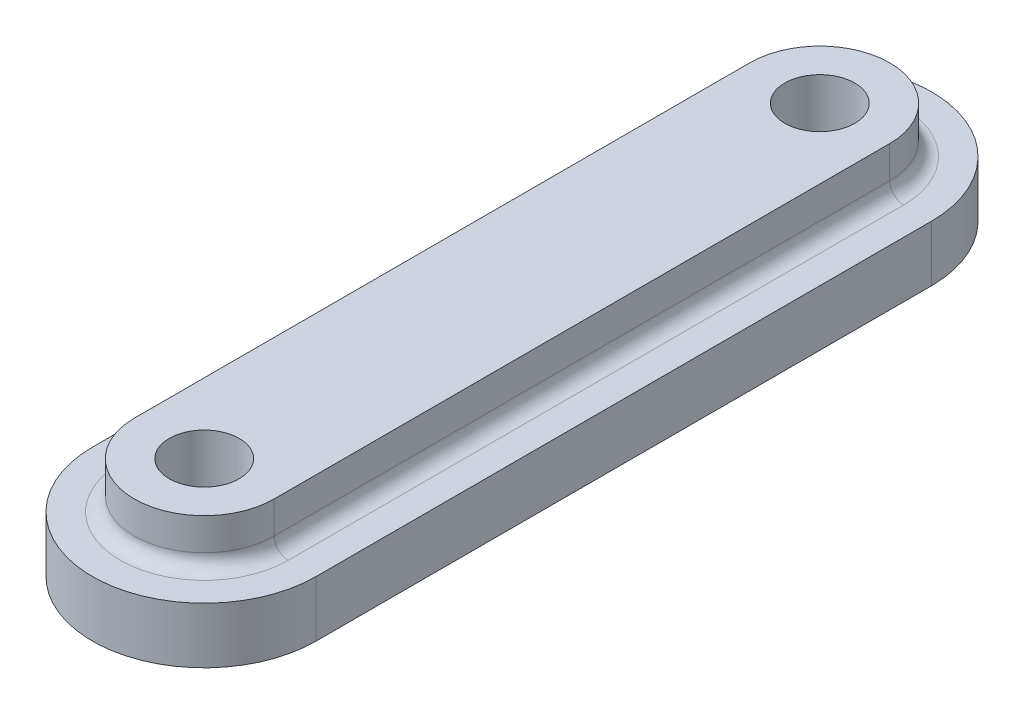
ISO-10303-21;
HEADER;
FILE_DESCRIPTION(('STEP AP214'),'2;1');
FILE_NAME('part.step','',(''),(''),'','','');
FILE_SCHEMA(('AUTOMOTIVE_DESIGN { 1 0 10303 214 1 1 1 1 }'));
ENDSEC;
DATA;
#1=APPLICATION_CONTEXT('core data for automotive mechanical design processes');
#2=APPLICATION_PROTOCOL_DEFINITION('international standard','automotive_design',2000,#1);
#3=PRODUCT_CONTEXT('',#1,'mechanical');
#4=PRODUCT('Part','Part','',(#3));
#5=PRODUCT_RELATED_PRODUCT_CATEGORY('part','',(#4));
#6=PRODUCT_DEFINITION_FORMATION('','',#4);
#7=PRODUCT_DEFINITION_CONTEXT('part definition',#1,'design');
#8=PRODUCT_DEFINITION('design','',#6,#7);
#9=PRODUCT_DEFINITION_SHAPE('','',#8);
#10=(LENGTH_UNIT() NAMED_UNIT(*) SI_UNIT(.MILLI.,.METRE.));
#11=(NAMED_UNIT(*) PLANE_ANGLE_UNIT() SI_UNIT($,.RADIAN.));
#12=(NAMED_UNIT(*) SI_UNIT($,.STERADIAN.) SOLID_ANGLE_UNIT());
#13=UNCERTAINTY_MEASURE_WITH_UNIT(LENGTH_MEASURE(1.E-05),#10,'distance_accuracy_value','');
#14=(GEOMETRIC_REPRESENTATION_CONTEXT(3) GLOBAL_UNCERTAINTY_ASSIGNED_CONTEXT((#13)) GLOBAL_UNIT_ASSIGNED_CONTEXT((#10,
#11,#12)) REPRESENTATION_CONTEXT('',''));
#15=CARTESIAN_POINT('',(0.,0.,0.));
#16=DIRECTION('',(0.,0.,1.));
#17=DIRECTION('',(1.,0.,0.));
#18=AXIS2_PLACEMENT_3D('',#15,#16,#17);
#19=CARTESIAN_POINT('',(38.,-2.825,11.));
#20=DIRECTION('',(0.,1.,0.));
#21=DIRECTION('',(0.,0.,1.));
#22=AXIS2_PLACEMENT_3D('',#19,#20,#21);
#23=CYLINDRICAL_SURFACE('',#22,4.);
#24=CARTESIAN_POINT('',(38.,-0.825,11.));
#25=DIRECTION('',(0.,1.,0.));
#26=DIRECTION('',(0.,0.,1.));
#27=AXIS2_PLACEMENT_3D('',#24,#25,#26);
#28=CIRCLE('',#27,4.);
#29=CARTESIAN_POINT('',(34.,-0.825,11.));
#30=VERTEX_POINT('',#29);
#31=CARTESIAN_POINT('',(42.,-0.825,11.));
#32=VERTEX_POINT('',#31);
#33=EDGE_CURVE('E135',#30,#32,#28,.T.);
#34=ORIENTED_EDGE('',*,*,#33,.F.);
#35=DIRECTION('',(0.,1.,0.));
#36=VECTOR('',#35,1.);
#37=CARTESIAN_POINT('',(34.,-2.825,11.));
#38=LINE('',#37,#36);
#39=CARTESIAN_POINT('',(34.,-2.825,11.));
#40=VERTEX_POINT('',#39);
#41=EDGE_CURVE('E165',#40,#30,#38,.T.);
#42=ORIENTED_EDGE('',*,*,#41,.F.);
#43=CARTESIAN_POINT('',(38.,-2.825,11.));
#44=DIRECTION('',(0.,1.,0.));
#45=DIRECTION('',(0.,0.,1.));
#46=AXIS2_PLACEMENT_3D('',#43,#44,#45);
#47=CIRCLE('',#46,4.);
#48=CARTESIAN_POINT('',(42.,-2.825,11.));
#49=VERTEX_POINT('',#48);
#50=EDGE_CURVE('E144',#40,#49,#47,.T.);
#51=ORIENTED_EDGE('',*,*,#50,.T.);
#52=DIRECTION('',(0.,1.,0.));
#53=VECTOR('',#52,1.);
#54=CARTESIAN_POINT('',(42.,-2.825,11.));
#55=LINE('',#54,#53);
#56=EDGE_CURVE('E156',#49,#32,#55,.T.);
#57=ORIENTED_EDGE('',*,*,#56,.T.);
#58=EDGE_LOOP('',(#34,#42,#51,#57));
#59=FACE_BOUND('',#58,.T.);
#60=ADVANCED_FACE('F33',(#59),#23,.T.);
#61=CARTESIAN_POINT('',(34.,-2.825,-11.));
#62=DIRECTION('',(-1.,0.,0.));
#63=DIRECTION('',(0.,0.,1.));
#64=AXIS2_PLACEMENT_3D('',#61,#62,#63);
#65=PLANE('',#64);
#66=DIRECTION('',(0.,0.,1.));
#67=VECTOR('',#66,1.);
#68=CARTESIAN_POINT('',(34.,-0.825,-11.));
#69=LINE('',#68,#67);
#70=CARTESIAN_POINT('',(34.,-0.825,-11.));
#71=VERTEX_POINT('',#70);
#72=EDGE_CURVE('E148',#71,#30,#69,.T.);
#73=ORIENTED_EDGE('',*,*,#72,.F.);
#74=DIRECTION('',(0.,1.,0.));
#75=VECTOR('',#74,1.);
#76=CARTESIAN_POINT('',(34.,-2.825,-11.));
#77=LINE('',#76,#75);
#78=CARTESIAN_POINT('',(34.,-2.825,-11.));
#79=VERTEX_POINT('',#78);
#80=EDGE_CURVE('E168',#79,#71,#77,.T.);
#81=ORIENTED_EDGE('',*,*,#80,.F.);
#82=DIRECTION('',(0.,0.,1.));
#83=VECTOR('',#82,1.);
#84=CARTESIAN_POINT('',(34.,-2.825,-11.));
#85=LINE('',#84,#83);
#86=EDGE_CURVE('E154',#79,#40,#85,.T.);
#87=ORIENTED_EDGE('',*,*,#86,.T.);
#88=ORIENTED_EDGE('',*,*,#41,.T.);
#89=EDGE_LOOP('',(#73,#81,#87,#88));
#90=FACE_BOUND('',#89,.T.);
#91=ADVANCED_FACE('F233',(#90),#65,.T.);
#92=CARTESIAN_POINT('',(38.,-2.825,-11.));
#93=DIRECTION('',(0.,1.,0.));
#94=DIRECTION('',(0.,0.,1.));
#95=AXIS2_PLACEMENT_3D('',#92,#93,#94);
#96=CYLINDRICAL_SURFACE('',#95,4.);
#97=CARTESIAN_POINT('',(38.,-0.825,-11.));
#98=DIRECTION('',(0.,1.,0.));
#99=DIRECTION('',(0.,0.,1.));
#100=AXIS2_PLACEMENT_3D('',#97,#98,#99);
#101=CIRCLE('',#100,4.);
#102=CARTESIAN_POINT('',(42.,-0.825,-11.));
#103=VERTEX_POINT('',#102);
#104=EDGE_CURVE('E160',#103,#71,#101,.T.);
#105=ORIENTED_EDGE('',*,*,#104,.F.);
#106=DIRECTION('',(0.,1.,0.));
#107=VECTOR('',#106,1.);
#108=CARTESIAN_POINT('',(42.,-2.825,-11.));
#109=LINE('',#108,#107);
#110=CARTESIAN_POINT('',(42.,-2.825,-11.));
#111=VERTEX_POINT('',#110);
#112=EDGE_CURVE('E170',#111,#103,#109,.T.);
#113=ORIENTED_EDGE('',*,*,#112,.F.);
#114=CARTESIAN_POINT('',(38.,-2.825,-11.));
#115=DIRECTION('',(0.,1.,0.));
#116=DIRECTION('',(0.,0.,1.));
#117=AXIS2_PLACEMENT_3D('',#114,#115,#116);
#118=CIRCLE('',#117,4.);
#119=EDGE_CURVE('E151',#111,#79,#118,.T.);
#120=ORIENTED_EDGE('',*,*,#119,.T.);
#121=ORIENTED_EDGE('',*,*,#80,.T.);
#122=EDGE_LOOP('',(#105,#113,#120,#121));
#123=FACE_BOUND('',#122,.T.);
#124=ADVANCED_FACE('F239',(#123),#96,.T.);
#125=CARTESIAN_POINT('',(42.,-2.825,11.));
#126=DIRECTION('',(1.,0.,0.));
#127=DIRECTION('',(0.,0.,-1.));
#128=AXIS2_PLACEMENT_3D('',#125,#126,#127);
#129=PLANE('',#128);
#130=DIRECTION('',(0.,0.,-1.));
#131=VECTOR('',#130,1.);
#132=CARTESIAN_POINT('',(42.,-0.825,11.));
#133=LINE('',#132,#131);
#134=EDGE_CURVE('E138',#32,#103,#133,.T.);
#135=ORIENTED_EDGE('',*,*,#134,.F.);
#136=ORIENTED_EDGE('',*,*,#56,.F.);
#137=DIRECTION('',(0.,0.,-1.));
#138=VECTOR('',#137,1.);
#139=CARTESIAN_POINT('',(42.,-2.825,11.));
#140=LINE('',#139,#138);
#141=EDGE_CURVE('E147',#49,#111,#140,.T.);
#142=ORIENTED_EDGE('',*,*,#141,.T.);
#143=ORIENTED_EDGE('',*,*,#112,.T.);
#144=EDGE_LOOP('',(#135,#136,#142,#143));
#145=FACE_BOUND('',#144,.T.);
#146=ADVANCED_FACE('F245',(#145),#129,.T.);
#147=CARTESIAN_POINT('',(38.,-2.825,11.));
#148=DIRECTION('',(0.,1.,0.));
#149=DIRECTION('',(0.,0.,1.));
#150=AXIS2_PLACEMENT_3D('',#147,#148,#149);
#151=PLANE('',#150);
#152=CARTESIAN_POINT('',(38.,-2.825,11.));
#153=DIRECTION('',(0.,1.,0.));
#154=DIRECTION('',(0.,0.,1.));
#155=AXIS2_PLACEMENT_3D('',#152,#153,#154);
#156=CIRCLE('',#155,1.24999999999999);
#157=CARTESIAN_POINT('',(38.,-2.825,12.25));
#158=VERTEX_POINT('',#157);
#159=EDGE_CURVE('E199',#158,#158,#156,.T.);
#160=ORIENTED_EDGE('',*,*,#159,.T.);
#161=EDGE_LOOP('',(#160));
#162=FACE_BOUND('',#161,.T.);
#163=CARTESIAN_POINT('',(38.,-2.825,-11.));
#164=DIRECTION('',(0.,1.,0.));
#165=DIRECTION('',(0.,0.,1.));
#166=AXIS2_PLACEMENT_3D('',#163,#164,#165);
#167=CIRCLE('',#166,1.24999999999999);
#168=CARTESIAN_POINT('',(38.,-2.825,-9.75000000000001));
#169=VERTEX_POINT('',#168);
#170=EDGE_CURVE('E130',#169,#169,#167,.T.);
#171=ORIENTED_EDGE('',*,*,#170,.T.);
#172=EDGE_LOOP('',(#171));
#173=FACE_BOUND('',#172,.T.);
#174=ORIENTED_EDGE('',*,*,#50,.F.);
#175=ORIENTED_EDGE('',*,*,#86,.F.);
#176=ORIENTED_EDGE('',*,*,#119,.F.);
#177=ORIENTED_EDGE('',*,*,#141,.F.);
#178=EDGE_LOOP('',(#174,#175,#176,#177));
#179=FACE_BOUND('',#178,.T.);
#180=ADVANCED_FACE('F298',(#162,#173,#179),#151,.F.);
#181=CARTESIAN_POINT('',(38.,-0.825,11.));
#182=DIRECTION('',(0.,1.,0.));
#183=DIRECTION('',(0.,0.,1.));
#184=AXIS2_PLACEMENT_3D('',#181,#182,#183);
#185=PLANE('',#184);
#186=CARTESIAN_POINT('',(38.,-0.825,-11.));
#187=DIRECTION('',(0.,1.,0.));
#188=DIRECTION('',(0.,0.,1.));
#189=AXIS2_PLACEMENT_3D('',#186,#187,#188);
#190=CIRCLE('',#189,3.);
#191=CARTESIAN_POINT('',(35.,-0.825,-11.));
#192=VERTEX_POINT('',#191);
#193=CARTESIAN_POINT('',(41.,-0.825,-11.));
#194=VERTEX_POINT('',#193);
#195=EDGE_CURVE('E176',#192,#194,#190,.F.);
#196=ORIENTED_EDGE('',*,*,#195,.T.);
#197=DIRECTION('',(0.,0.,-1.));
#198=VECTOR('',#197,1.);
#199=CARTESIAN_POINT('',(41.,-0.825,11.));
#200=LINE('',#199,#198);
#201=CARTESIAN_POINT('',(41.,-0.825,11.));
#202=VERTEX_POINT('',#201);
#203=EDGE_CURVE('E180',#194,#202,#200,.F.);
#204=ORIENTED_EDGE('',*,*,#203,.T.);
#205=CARTESIAN_POINT('',(38.,-0.825,11.));
#206=DIRECTION('',(0.,1.,0.));
#207=DIRECTION('',(0.,0.,1.));
#208=AXIS2_PLACEMENT_3D('',#205,#206,#207);
#209=CIRCLE('',#208,3.);
#210=CARTESIAN_POINT('',(35.,-0.825,11.));
#211=VERTEX_POINT('',#210);
#212=EDGE_CURVE('E178',#202,#211,#209,.F.);
#213=ORIENTED_EDGE('',*,*,#212,.T.);
#214=DIRECTION('',(0.,0.,1.));
#215=VECTOR('',#214,1.);
#216=CARTESIAN_POINT('',(35.,-0.825,11.));
#217=LINE('',#216,#215);
#218=EDGE_CURVE('E174',#211,#192,#217,.F.);
#219=ORIENTED_EDGE('',*,*,#218,.T.);
#220=EDGE_LOOP('',(#196,#204,#213,#219));
#221=FACE_BOUND('',#220,.T.);
#222=ORIENTED_EDGE('',*,*,#33,.T.);
#223=ORIENTED_EDGE('',*,*,#134,.T.);
#224=ORIENTED_EDGE('',*,*,#104,.T.);
#225=ORIENTED_EDGE('',*,*,#72,.T.);
#226=EDGE_LOOP('',(#222,#223,#224,#225));
#227=FACE_BOUND('',#226,.T.);
#228=ADVANCED_FACE('F293',(#221,#227),#185,.T.);
#229=CARTESIAN_POINT('',(38.,0.825,11.));
#230=DIRECTION('',(0.,-1.,0.));
#231=DIRECTION('',(0.,0.,-1.));
#232=AXIS2_PLACEMENT_3D('',#229,#230,#231);
#233=CYLINDRICAL_SURFACE('',#232,2.5);
#234=DIRECTION('',(0.,-1.,0.));
#235=VECTOR('',#234,1.);
#236=CARTESIAN_POINT('',(35.5,0.825,11.));
#237=LINE('',#236,#235);
#238=CARTESIAN_POINT('',(35.5,0.825,11.));
#239=VERTEX_POINT('',#238);
#240=CARTESIAN_POINT('',(35.5,-0.325,11.));
#241=VERTEX_POINT('',#240);
#242=EDGE_CURVE('E213',#239,#241,#237,.T.);
#243=ORIENTED_EDGE('',*,*,#242,.T.);
#244=CARTESIAN_POINT('',(38.,-0.325,11.));
#245=DIRECTION('',(0.,1.,0.));
#246=DIRECTION('',(0.,0.,1.));
#247=AXIS2_PLACEMENT_3D('',#244,#245,#246);
#248=CIRCLE('',#247,2.5);
#249=CARTESIAN_POINT('',(40.5,-0.325,11.));
#250=VERTEX_POINT('',#249);
#251=EDGE_CURVE('E134',#241,#250,#248,.T.);
#252=ORIENTED_EDGE('',*,*,#251,.T.);
#253=DIRECTION('',(0.,-1.,0.));
#254=VECTOR('',#253,1.);
#255=CARTESIAN_POINT('',(40.5,0.825,11.));
#256=LINE('',#255,#254);
#257=CARTESIAN_POINT('',(40.5,0.825,11.));
#258=VERTEX_POINT('',#257);
#259=EDGE_CURVE('E117',#258,#250,#256,.T.);
#260=ORIENTED_EDGE('',*,*,#259,.F.);
#261=CARTESIAN_POINT('',(38.,0.825,11.));
#262=DIRECTION('',(0.,1.,0.));
#263=DIRECTION('',(0.,0.,-1.));
#264=AXIS2_PLACEMENT_3D('',#261,#262,#263);
#265=CIRCLE('',#264,2.5);
#266=EDGE_CURVE('E123',#239,#258,#265,.T.);
#267=ORIENTED_EDGE('',*,*,#266,.F.);
#268=EDGE_LOOP('',(#243,#252,#260,#267));
#269=FACE_BOUND('',#268,.T.);
#270=ADVANCED_FACE('F132',(#269),#233,.T.);
#271=CARTESIAN_POINT('',(40.5,0.825,-11.));
#272=DIRECTION('',(-1.,0.,0.));
#273=DIRECTION('',(0.,0.,1.));
#274=AXIS2_PLACEMENT_3D('',#271,#272,#273);
#275=PLANE('',#274);
#276=ORIENTED_EDGE('',*,*,#259,.T.);
#277=DIRECTION('',(0.,0.,-1.));
#278=VECTOR('',#277,1.);
#279=CARTESIAN_POINT('',(40.5,-0.325,-11.));
#280=LINE('',#279,#278);
#281=CARTESIAN_POINT('',(40.5,-0.325,-11.));
#282=VERTEX_POINT('',#281);
#283=EDGE_CURVE('E167',#250,#282,#280,.T.);
#284=ORIENTED_EDGE('',*,*,#283,.T.);
#285=DIRECTION('',(0.,-1.,0.));
#286=VECTOR('',#285,1.);
#287=CARTESIAN_POINT('',(40.5,0.825,-11.));
#288=LINE('',#287,#286);
#289=CARTESIAN_POINT('',(40.5,0.825,-11.));
#290=VERTEX_POINT('',#289);
#291=EDGE_CURVE('E119',#290,#282,#288,.T.);
#292=ORIENTED_EDGE('',*,*,#291,.F.);
#293=DIRECTION('',(0.,0.,-1.));
#294=VECTOR('',#293,1.);
#295=CARTESIAN_POINT('',(40.5,0.825,-11.));
#296=LINE('',#295,#294);
#297=EDGE_CURVE('E112',#258,#290,#296,.T.);
#298=ORIENTED_EDGE('',*,*,#297,.F.);
#299=EDGE_LOOP('',(#276,#284,#292,#298));
#300=FACE_BOUND('',#299,.T.);
#301=ADVANCED_FACE('F114',(#300),#275,.F.);
#302=CARTESIAN_POINT('',(38.,0.825,-11.));
#303=DIRECTION('',(0.,-1.,0.));
#304=DIRECTION('',(0.,0.,-1.));
#305=AXIS2_PLACEMENT_3D('',#302,#303,#304);
#306=CYLINDRICAL_SURFACE('',#305,2.5);
#307=ORIENTED_EDGE('',*,*,#291,.T.);
#308=CARTESIAN_POINT('',(38.,-0.325,-11.));
#309=DIRECTION('',(0.,1.,0.));
#310=DIRECTION('',(0.,0.,1.));
#311=AXIS2_PLACEMENT_3D('',#308,#309,#310);
#312=CIRCLE('',#311,2.5);
#313=CARTESIAN_POINT('',(35.5,-0.325,-11.));
#314=VERTEX_POINT('',#313);
#315=EDGE_CURVE('E42',#282,#314,#312,.T.);
#316=ORIENTED_EDGE('',*,*,#315,.T.);
#317=DIRECTION('',(0.,-1.,0.));
#318=VECTOR('',#317,1.);
#319=CARTESIAN_POINT('',(35.5,0.825,-11.));
#320=LINE('',#319,#318);
#321=CARTESIAN_POINT('',(35.5,0.825,-11.));
#322=VERTEX_POINT('',#321);
#323=EDGE_CURVE('E140',#322,#314,#320,.T.);
#324=ORIENTED_EDGE('',*,*,#323,.F.);
#325=CARTESIAN_POINT('',(38.,0.825,-11.));
#326=DIRECTION('',(0.,1.,0.));
#327=DIRECTION('',(0.,0.,-1.));
#328=AXIS2_PLACEMENT_3D('',#325,#326,#327);
#329=CIRCLE('',#328,2.5);
#330=EDGE_CURVE('E122',#290,#322,#329,.T.);
#331=ORIENTED_EDGE('',*,*,#330,.F.);
#332=EDGE_LOOP('',(#307,#316,#324,#331));
#333=FACE_BOUND('',#332,.T.);
#334=ADVANCED_FACE('F223',(#333),#306,.T.);
#335=CARTESIAN_POINT('',(35.5,0.825,11.));
#336=DIRECTION('',(1.,0.,0.));
#337=DIRECTION('',(0.,0.,-1.));
#338=AXIS2_PLACEMENT_3D('',#335,#336,#337);
#339=PLANE('',#338);
#340=ORIENTED_EDGE('',*,*,#323,.T.);
#341=DIRECTION('',(0.,0.,1.));
#342=VECTOR('',#341,1.);
#343=CARTESIAN_POINT('',(35.5,-0.325,11.));
#344=LINE('',#343,#342);
#345=EDGE_CURVE('E11',#314,#241,#344,.T.);
#346=ORIENTED_EDGE('',*,*,#345,.T.);
#347=ORIENTED_EDGE('',*,*,#242,.F.);
#348=DIRECTION('',(0.,0.,1.));
#349=VECTOR('',#348,1.);
#350=CARTESIAN_POINT('',(35.5,0.825,11.));
#351=LINE('',#350,#349);
#352=EDGE_CURVE('E128',#322,#239,#351,.T.);
#353=ORIENTED_EDGE('',*,*,#352,.F.);
#354=EDGE_LOOP('',(#340,#346,#347,#353));
#355=FACE_BOUND('',#354,.T.);
#356=ADVANCED_FACE('F214',(#355),#339,.F.);
#357=CARTESIAN_POINT('',(38.,0.825,11.));
#358=DIRECTION('',(0.,-1.,0.));
#359=DIRECTION('',(0.,0.,-1.));
#360=AXIS2_PLACEMENT_3D('',#357,#358,#359);
#361=PLANE('',#360);
#362=CARTESIAN_POINT('',(38.,0.825000000000001,11.));
#363=DIRECTION('',(0.,1.,0.));
#364=DIRECTION('',(0.,0.,1.));
#365=AXIS2_PLACEMENT_3D('',#362,#363,#364);
#366=CIRCLE('',#365,1.24999999999999);
#367=CARTESIAN_POINT('',(38.,0.825000000000001,12.25));
#368=VERTEX_POINT('',#367);
#369=EDGE_CURVE('E194',#368,#368,#366,.T.);
#370=ORIENTED_EDGE('',*,*,#369,.F.);
#371=EDGE_LOOP('',(#370));
#372=FACE_BOUND('',#371,.T.);
#373=CARTESIAN_POINT('',(38.,0.825000000000001,-11.));
#374=DIRECTION('',(0.,1.,0.));
#375=DIRECTION('',(0.,0.,1.));
#376=AXIS2_PLACEMENT_3D('',#373,#374,#375);
#377=CIRCLE('',#376,1.24999999999999);
#378=CARTESIAN_POINT('',(38.,0.825000000000001,-9.75000000000001));
#379=VERTEX_POINT('',#378);
#380=EDGE_CURVE('E204',#379,#379,#377,.T.);
#381=ORIENTED_EDGE('',*,*,#380,.F.);
#382=EDGE_LOOP('',(#381));
#383=FACE_BOUND('',#382,.T.);
#384=ORIENTED_EDGE('',*,*,#266,.T.);
#385=ORIENTED_EDGE('',*,*,#297,.T.);
#386=ORIENTED_EDGE('',*,*,#330,.T.);
#387=ORIENTED_EDGE('',*,*,#352,.T.);
#388=EDGE_LOOP('',(#384,#385,#386,#387));
#389=FACE_BOUND('',#388,.T.);
#390=ADVANCED_FACE('F126',(#372,#383,#389),#361,.F.);
#391=CARTESIAN_POINT('',(38.,0.825,-11.));
#392=DIRECTION('',(0.,1.,0.));
#393=DIRECTION('',(0.,0.,1.));
#394=AXIS2_PLACEMENT_3D('',#391,#392,#393);
#395=CYLINDRICAL_SURFACE('',#394,1.24999999999999);
#396=ORIENTED_EDGE('',*,*,#170,.F.);
#397=EDGE_LOOP('',(#396));
#398=FACE_BOUND('',#397,.T.);
#399=ORIENTED_EDGE('',*,*,#380,.T.);
#400=EDGE_LOOP('',(#399));
#401=FACE_BOUND('',#400,.T.);
#402=ADVANCED_FACE('F259',(#398,#401),#395,.F.);
#403=CARTESIAN_POINT('',(38.,0.825,11.));
#404=DIRECTION('',(0.,1.,0.));
#405=DIRECTION('',(0.,0.,1.));
#406=AXIS2_PLACEMENT_3D('',#403,#404,#405);
#407=CYLINDRICAL_SURFACE('',#406,1.24999999999999);
#408=ORIENTED_EDGE('',*,*,#159,.F.);
#409=EDGE_LOOP('',(#408));
#410=FACE_BOUND('',#409,.T.);
#411=ORIENTED_EDGE('',*,*,#369,.T.);
#412=EDGE_LOOP('',(#411));
#413=FACE_BOUND('',#412,.T.);
#414=ADVANCED_FACE('F255',(#410,#413),#407,.F.);
#415=CARTESIAN_POINT('',(35.,-0.325,11.));
#416=DIRECTION('',(0.,0.,1.));
#417=DIRECTION('',(1.,0.,0.));
#418=AXIS2_PLACEMENT_3D('',#415,#416,#417);
#419=CYLINDRICAL_SURFACE('',#418,0.5);
#420=CARTESIAN_POINT('',(35.,-0.325,-11.));
#421=DIRECTION('',(0.,0.,1.));
#422=DIRECTION('',(1.,0.,0.));
#423=AXIS2_PLACEMENT_3D('',#420,#421,#422);
#424=CIRCLE('',#423,0.5);
#425=EDGE_CURVE('E188',#192,#314,#424,.T.);
#426=ORIENTED_EDGE('',*,*,#425,.F.);
#427=ORIENTED_EDGE('',*,*,#218,.F.);
#428=CARTESIAN_POINT('',(35.,-0.325,11.));
#429=DIRECTION('',(0.,0.,-1.));
#430=DIRECTION('',(-1.,0.,0.));
#431=AXIS2_PLACEMENT_3D('',#428,#429,#430);
#432=CIRCLE('',#431,0.5);
#433=EDGE_CURVE('E37',#241,#211,#432,.T.);
#434=ORIENTED_EDGE('',*,*,#433,.F.);
#435=ORIENTED_EDGE('',*,*,#345,.F.);
#436=EDGE_LOOP('',(#426,#427,#434,#435));
#437=FACE_BOUND('',#436,.T.);
#438=ADVANCED_FACE('F35',(#437),#419,.F.);
#439=CARTESIAN_POINT('',(38.,-0.325,11.));
#440=DIRECTION('',(0.,1.,0.));
#441=DIRECTION('',(0.,0.,1.));
#442=AXIS2_PLACEMENT_3D('',#439,#440,#441);
#443=TOROIDAL_SURFACE('',#442,3.,0.5);
#444=ORIENTED_EDGE('',*,*,#433,.T.);
#445=ORIENTED_EDGE('',*,*,#212,.F.);
#446=CARTESIAN_POINT('',(41.,-0.325,11.));
#447=DIRECTION('',(0.,0.,1.));
#448=DIRECTION('',(1.,0.,0.));
#449=AXIS2_PLACEMENT_3D('',#446,#447,#448);
#450=CIRCLE('',#449,0.5);
#451=EDGE_CURVE('E187',#250,#202,#450,.T.);
#452=ORIENTED_EDGE('',*,*,#451,.F.);
#453=ORIENTED_EDGE('',*,*,#251,.F.);
#454=EDGE_LOOP('',(#444,#445,#452,#453));
#455=FACE_BOUND('',#454,.T.);
#456=ADVANCED_FACE('F217',(#455),#443,.F.);
#457=CARTESIAN_POINT('',(38.,-0.325,-11.));
#458=DIRECTION('',(0.,1.,0.));
#459=DIRECTION('',(0.,0.,1.));
#460=AXIS2_PLACEMENT_3D('',#457,#458,#459);
#461=TOROIDAL_SURFACE('',#460,3.,0.5);
#462=ORIENTED_EDGE('',*,*,#425,.T.);
#463=ORIENTED_EDGE('',*,*,#315,.F.);
#464=CARTESIAN_POINT('',(41.,-0.325,-11.));
#465=DIRECTION('',(0.,0.,-1.));
#466=DIRECTION('',(-1.,0.,0.));
#467=AXIS2_PLACEMENT_3D('',#464,#465,#466);
#468=CIRCLE('',#467,0.5);
#469=EDGE_CURVE('E185',#194,#282,#468,.T.);
#470=ORIENTED_EDGE('',*,*,#469,.F.);
#471=ORIENTED_EDGE('',*,*,#195,.F.);
#472=EDGE_LOOP('',(#462,#463,#470,#471));
#473=FACE_BOUND('',#472,.T.);
#474=ADVANCED_FACE('F249',(#473),#461,.F.);
#475=CARTESIAN_POINT('',(41.,-0.325,-11.));
#476=DIRECTION('',(0.,0.,-1.));
#477=DIRECTION('',(-1.,0.,0.));
#478=AXIS2_PLACEMENT_3D('',#475,#476,#477);
#479=CYLINDRICAL_SURFACE('',#478,0.5);
#480=ORIENTED_EDGE('',*,*,#451,.T.);
#481=ORIENTED_EDGE('',*,*,#203,.F.);
#482=ORIENTED_EDGE('',*,*,#469,.T.);
#483=ORIENTED_EDGE('',*,*,#283,.F.);
#484=EDGE_LOOP('',(#480,#481,#482,#483));
#485=FACE_BOUND('',#484,.T.);
#486=ADVANCED_FACE('F221',(#485),#479,.F.);
#487=CLOSED_SHELL('',(#60,#91,#124,#146,#180,#228,#270,#301,#334,#356,#390,#402,#414,#438,#456,
#474,#486));
#488=MANIFOLD_SOLID_BREP('B2',#487);
#489=ADVANCED_BREP_SHAPE_REPRESENTATION('',(#18,#488),#14);
#490=SHAPE_DEFINITION_REPRESENTATION(#9,#489);
ENDSEC;
END-ISO-10303-21;
